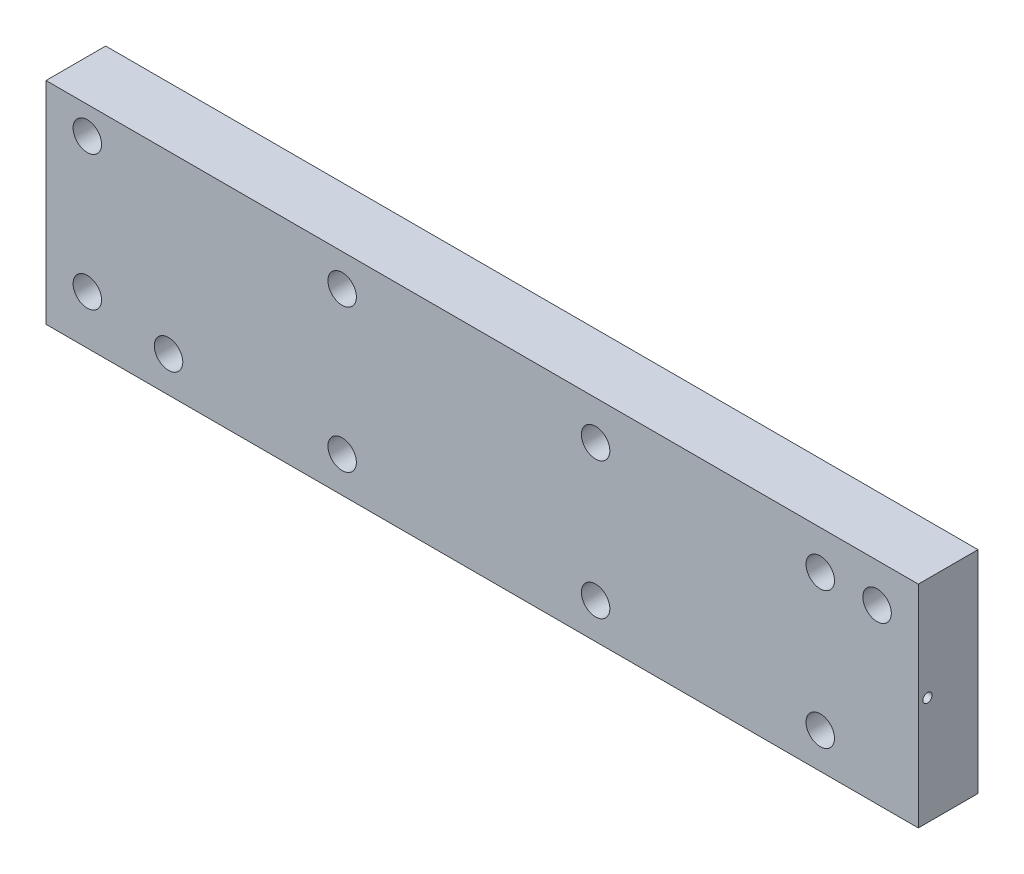
ISO-10303-21;
HEADER;
FILE_DESCRIPTION(('STEP AP214'),'2;1');
FILE_NAME('part.step','',(''),(''),'','','');
FILE_SCHEMA(('AUTOMOTIVE_DESIGN { 1 0 10303 214 1 1 1 1 }'));
ENDSEC;
DATA;
#1=APPLICATION_CONTEXT('core data for automotive mechanical design processes');
#2=APPLICATION_PROTOCOL_DEFINITION('international standard','automotive_design',2000,#1);
#3=PRODUCT_CONTEXT('',#1,'mechanical');
#4=PRODUCT('Part','Part','',(#3));
#5=PRODUCT_RELATED_PRODUCT_CATEGORY('part','',(#4));
#6=PRODUCT_DEFINITION_FORMATION('','',#4);
#7=PRODUCT_DEFINITION_CONTEXT('part definition',#1,'design');
#8=PRODUCT_DEFINITION('design','',#6,#7);
#9=PRODUCT_DEFINITION_SHAPE('','',#8);
#10=(LENGTH_UNIT() NAMED_UNIT(*) SI_UNIT(.MILLI.,.METRE.));
#11=(NAMED_UNIT(*) PLANE_ANGLE_UNIT() SI_UNIT($,.RADIAN.));
#12=(NAMED_UNIT(*) SI_UNIT($,.STERADIAN.) SOLID_ANGLE_UNIT());
#13=UNCERTAINTY_MEASURE_WITH_UNIT(LENGTH_MEASURE(1.E-05),#10,'distance_accuracy_value','');
#14=(GEOMETRIC_REPRESENTATION_CONTEXT(3) GLOBAL_UNCERTAINTY_ASSIGNED_CONTEXT((#13)) GLOBAL_UNIT_ASSIGNED_CONTEXT((#10,
#11,#12)) REPRESENTATION_CONTEXT('',''));
#15=CARTESIAN_POINT('',(0.,0.,0.));
#16=DIRECTION('',(0.,0.,1.));
#17=DIRECTION('',(1.,0.,0.));
#18=AXIS2_PLACEMENT_3D('',#15,#16,#17);
#19=CARTESIAN_POINT('',(12.49,31.,15.));
#20=DIRECTION('',(0.,0.,1.));
#21=DIRECTION('',(0.,-1.,0.));
#22=AXIS2_PLACEMENT_3D('',#19,#20,#21);
#23=PLANE('',#22);
#24=CARTESIAN_POINT('',(72.3541968671441,26.7675678602719,15.));
#25=DIRECTION('',(0.,0.,1.));
#26=DIRECTION('',(0.,-1.,0.));
#27=AXIS2_PLACEMENT_3D('',#24,#25,#26);
#28=CIRCLE('',#27,1.55);
#29=CARTESIAN_POINT('',(72.3541968671441,25.2175678602719,15.));
#30=VERTEX_POINT('',#29);
#31=EDGE_CURVE('E441',#30,#30,#28,.F.);
#32=ORIENTED_EDGE('',*,*,#31,.F.);
#33=EDGE_LOOP('',(#32));
#34=FACE_BOUND('',#33,.T.);
#35=CARTESIAN_POINT('',(103.008357344342,26.7675678602719,15.));
#36=DIRECTION('',(0.,0.,1.));
#37=DIRECTION('',(0.,-1.,0.));
#38=AXIS2_PLACEMENT_3D('',#35,#36,#37);
#39=CIRCLE('',#38,1.55);
#40=CARTESIAN_POINT('',(103.008357344342,25.2175678602719,15.));
#41=VERTEX_POINT('',#40);
#42=EDGE_CURVE('E436',#41,#41,#39,.F.);
#43=ORIENTED_EDGE('',*,*,#42,.F.);
#44=EDGE_LOOP('',(#43));
#45=FACE_BOUND('',#44,.T.);
#46=CARTESIAN_POINT('',(25.8461530651009,11.8834878470165,15.));
#47=DIRECTION('',(0.,0.,1.));
#48=DIRECTION('',(0.,-1.,0.));
#49=AXIS2_PLACEMENT_3D('',#46,#47,#48);
#50=CIRCLE('',#49,1.54999999999999);
#51=CARTESIAN_POINT('',(25.8461530651009,10.3334878470165,15.));
#52=VERTEX_POINT('',#51);
#53=EDGE_CURVE('E430',#52,#52,#50,.F.);
#54=ORIENTED_EDGE('',*,*,#53,.F.);
#55=EDGE_LOOP('',(#54));
#56=FACE_BOUND('',#55,.T.);
#57=CARTESIAN_POINT('',(72.3541968671441,11.8834878470165,15.));
#58=DIRECTION('',(0.,0.,1.));
#59=DIRECTION('',(0.,-1.,0.));
#60=AXIS2_PLACEMENT_3D('',#57,#58,#59);
#61=CIRCLE('',#60,1.55);
#62=CARTESIAN_POINT('',(72.3541968671441,10.3334878470165,15.));
#63=VERTEX_POINT('',#62);
#64=EDGE_CURVE('E424',#63,#63,#61,.F.);
#65=ORIENTED_EDGE('',*,*,#64,.F.);
#66=EDGE_LOOP('',(#65));
#67=FACE_BOUND('',#66,.T.);
#68=CARTESIAN_POINT('',(17.,28.,15.));
#69=DIRECTION('',(0.,0.,1.));
#70=DIRECTION('',(0.,-1.,0.));
#71=AXIS2_PLACEMENT_3D('',#68,#69,#70);
#72=CIRCLE('',#71,1.54999999999999);
#73=CARTESIAN_POINT('',(17.,26.45,15.));
#74=VERTEX_POINT('',#73);
#75=EDGE_CURVE('E419',#74,#74,#72,.F.);
#76=ORIENTED_EDGE('',*,*,#75,.F.);
#77=EDGE_LOOP('',(#76));
#78=FACE_BOUND('',#77,.T.);
#79=DIRECTION('',(0.,1.,0.));
#80=VECTOR('',#79,1.);
#81=CARTESIAN_POINT('',(14.5,19.4953488288822,15.));
#82=LINE('',#81,#80);
#83=CARTESIAN_POINT('',(14.5000000000001,22.5953488288822,15.));
#84=VERTEX_POINT('',#83);
#85=CARTESIAN_POINT('',(14.5,19.4953488288822,15.));
#86=VERTEX_POINT('',#85);
#87=EDGE_CURVE('E411',#84,#86,#82,.F.);
#88=ORIENTED_EDGE('',*,*,#87,.T.);
#89=DIRECTION('',(0.00465114596278457,0.999989183362117,0.));
#90=VECTOR('',#89,1.);
#91=CARTESIAN_POINT('',(14.5,19.4953488288822,15.));
#92=LINE('',#91,#90);
#93=CARTESIAN_POINT('',(14.4855814475155,16.3953823604596,15.));
#94=VERTEX_POINT('',#93);
#95=EDGE_CURVE('E59',#86,#94,#92,.F.);
#96=ORIENTED_EDGE('',*,*,#95,.T.);
#97=DIRECTION('',(0.999989183362117,-0.00465114596278426,0.));
#98=VECTOR('',#97,1.);
#99=CARTESIAN_POINT('',(-1318.49761349806,22.5953488288822,15.));
#100=LINE('',#99,#98);
#101=CARTESIAN_POINT('',(19.985521956007,16.3698010576642,15.));
#102=VERTEX_POINT('',#101);
#103=EDGE_CURVE('E410',#94,#102,#100,.T.);
#104=ORIENTED_EDGE('',*,*,#103,.T.);
#105=DIRECTION('',(0.00465114596278391,0.999989183362117,0.));
#106=VECTOR('',#105,1.);
#107=CARTESIAN_POINT('',(20.,19.4825581083082,15.));
#108=LINE('',#107,#106);
#109=CARTESIAN_POINT('',(19.9738940911,13.869828099259,15.));
#110=VERTEX_POINT('',#109);
#111=EDGE_CURVE('E455',#102,#110,#108,.F.);
#112=ORIENTED_EDGE('',*,*,#111,.T.);
#113=DIRECTION('',(0.999859873952876,0.0167401451289695,0.));
#114=VECTOR('',#113,1.);
#115=CARTESIAN_POINT('',(314.329260657533,18.7980702301612,15.));
#116=LINE('',#115,#114);
#117=CARTESIAN_POINT('',(99.980989793061,15.2093461940355,15.));
#118=VERTEX_POINT('',#117);
#119=EDGE_CURVE('E389',#110,#118,#116,.T.);
#120=ORIENTED_EDGE('',*,*,#119,.T.);
#121=DIRECTION('',(0.00465114596277969,0.999989183362117,0.));
#122=VECTOR('',#121,1.);
#123=CARTESIAN_POINT('',(100.,19.2965112635962,15.));
#124=LINE('',#123,#122);
#125=CARTESIAN_POINT('',(99.9926176579679,17.7093191524382,15.));
#126=VERTEX_POINT('',#125);
#127=EDGE_CURVE('E384',#118,#126,#124,.T.);
#128=ORIENTED_EDGE('',*,*,#127,.T.);
#129=DIRECTION('',(0.999989183362117,-0.00465114596278422,0.));
#130=VECTOR('',#129,1.);
#131=CARTESIAN_POINT('',(-582.498768257076,20.8837205430223,15.));
#132=LINE('',#131,#130);
#133=CARTESIAN_POINT('',(105.49255816646,17.6837378496429,15.));
#134=VERTEX_POINT('',#133);
#135=EDGE_CURVE('E377',#126,#134,#132,.T.);
#136=ORIENTED_EDGE('',*,*,#135,.T.);
#137=DIRECTION('',(0.00465114596278457,0.999989183362117,0.));
#138=VECTOR('',#137,1.);
#139=CARTESIAN_POINT('',(105.5,19.2837205430222,15.));
#140=LINE('',#139,#138);
#141=CARTESIAN_POINT('',(105.5,19.2837205430222,15.));
#142=VERTEX_POINT('',#141);
#143=EDGE_CURVE('E11',#134,#142,#140,.T.);
#144=ORIENTED_EDGE('',*,*,#143,.T.);
#145=DIRECTION('',(0.,1.,0.));
#146=VECTOR('',#145,1.);
#147=CARTESIAN_POINT('',(105.5,19.2837205430222,15.));
#148=LINE('',#147,#146);
#149=CARTESIAN_POINT('',(105.5,20.8837205430222,15.));
#150=VERTEX_POINT('',#149);
#151=EDGE_CURVE('E45',#142,#150,#148,.T.);
#152=ORIENTED_EDGE('',*,*,#151,.T.);
#153=DIRECTION('',(-1.,0.,0.));
#154=VECTOR('',#153,1.);
#155=CARTESIAN_POINT('',(-582.498768257076,20.8837205430223,15.));
#156=LINE('',#155,#154);
#157=CARTESIAN_POINT('',(100.,20.8837205430222,15.));
#158=VERTEX_POINT('',#157);
#159=EDGE_CURVE('E383',#150,#158,#156,.T.);
#160=ORIENTED_EDGE('',*,*,#159,.T.);
#161=DIRECTION('',(0.,1.,0.));
#162=VECTOR('',#161,1.);
#163=CARTESIAN_POINT('',(100.,19.2965112635962,15.));
#164=LINE('',#163,#162);
#165=CARTESIAN_POINT('',(100.,23.3837205430197,15.));
#166=VERTEX_POINT('',#165);
#167=EDGE_CURVE('E392',#158,#166,#164,.T.);
#168=ORIENTED_EDGE('',*,*,#167,.T.);
#169=DIRECTION('',(-0.999771197972252,0.0213904582729674,0.));
#170=VECTOR('',#169,1.);
#171=CARTESIAN_POINT('',(314.329260657533,18.7980702301612,15.));
#172=LINE('',#171,#170);
#173=CARTESIAN_POINT('',(20.,25.0953488288822,15.));
#174=VERTEX_POINT('',#173);
#175=EDGE_CURVE('E414',#166,#174,#172,.T.);
#176=ORIENTED_EDGE('',*,*,#175,.T.);
#177=DIRECTION('',(0.,1.,0.));
#178=VECTOR('',#177,1.);
#179=CARTESIAN_POINT('',(20.,19.4825581083082,15.));
#180=LINE('',#179,#178);
#181=CARTESIAN_POINT('',(20.,22.5953488288823,15.));
#182=VERTEX_POINT('',#181);
#183=EDGE_CURVE('E460',#174,#182,#180,.F.);
#184=ORIENTED_EDGE('',*,*,#183,.T.);
#185=DIRECTION('',(-1.,0.,0.));
#186=VECTOR('',#185,1.);
#187=CARTESIAN_POINT('',(-1318.49761349806,22.5953488288822,15.));
#188=LINE('',#187,#186);
#189=EDGE_CURVE('E407',#182,#84,#188,.T.);
#190=ORIENTED_EDGE('',*,*,#189,.T.);
#191=EDGE_LOOP('',(#88,#96,#104,#112,#120,#128,#136,#144,#152,#160,#168,#176,#184,#190));
#192=FACE_BOUND('',#191,.T.);
#193=DIRECTION('',(1.,0.,0.));
#194=VECTOR('',#193,1.);
#195=CARTESIAN_POINT('',(135.,31.,15.));
#196=LINE('',#195,#194);
#197=CARTESIAN_POINT('',(12.5,31.,15.));
#198=VERTEX_POINT('',#197);
#199=CARTESIAN_POINT('',(107.5,31.,15.));
#200=VERTEX_POINT('',#199);
#201=EDGE_CURVE('E446',#198,#200,#196,.T.);
#202=ORIENTED_EDGE('',*,*,#201,.T.);
#203=DIRECTION('',(0.,1.,0.));
#204=VECTOR('',#203,1.);
#205=CARTESIAN_POINT('',(107.5,-104.,15.));
#206=LINE('',#205,#204);
#207=CARTESIAN_POINT('',(107.5,8.,15.));
#208=VERTEX_POINT('',#207);
#209=EDGE_CURVE('E147',#208,#200,#206,.T.);
#210=ORIENTED_EDGE('',*,*,#209,.F.);
#211=DIRECTION('',(1.,0.,0.));
#212=VECTOR('',#211,1.);
#213=CARTESIAN_POINT('',(135.,8.,15.));
#214=LINE('',#213,#212);
#215=CARTESIAN_POINT('',(12.5,8.,15.));
#216=VERTEX_POINT('',#215);
#217=EDGE_CURVE('E444',#216,#208,#214,.T.);
#218=ORIENTED_EDGE('',*,*,#217,.F.);
#219=DIRECTION('',(0.,-1.,0.));
#220=VECTOR('',#219,1.);
#221=CARTESIAN_POINT('',(12.5,-104.,15.));
#222=LINE('',#221,#220);
#223=EDGE_CURVE('E230',#198,#216,#222,.T.);
#224=ORIENTED_EDGE('',*,*,#223,.F.);
#225=EDGE_LOOP('',(#202,#210,#218,#224));
#226=FACE_BOUND('',#225,.T.);
#227=CARTESIAN_POINT('',(96.8197135493571,11.8834878470165,15.));
#228=DIRECTION('',(0.,0.,1.));
#229=DIRECTION('',(0.,-1.,0.));
#230=AXIS2_PLACEMENT_3D('',#227,#228,#229);
#231=CIRCLE('',#230,1.55);
#232=CARTESIAN_POINT('',(96.8197135493571,10.3334878470165,15.));
#233=VERTEX_POINT('',#232);
#234=EDGE_CURVE('E422',#233,#233,#231,.F.);
#235=ORIENTED_EDGE('',*,*,#234,.F.);
#236=EDGE_LOOP('',(#235));
#237=FACE_BOUND('',#236,.T.);
#238=CARTESIAN_POINT('',(44.7527820765865,11.8834878470165,15.));
#239=DIRECTION('',(0.,0.,1.));
#240=DIRECTION('',(0.,-1.,0.));
#241=AXIS2_PLACEMENT_3D('',#238,#239,#240);
#242=CIRCLE('',#241,1.55);
#243=CARTESIAN_POINT('',(44.7527820765865,10.3334878470165,15.));
#244=VERTEX_POINT('',#243);
#245=EDGE_CURVE('E427',#244,#244,#242,.F.);
#246=ORIENTED_EDGE('',*,*,#245,.F.);
#247=EDGE_LOOP('',(#246));
#248=FACE_BOUND('',#247,.T.);
#249=CARTESIAN_POINT('',(17.,13.3193439369581,15.));
#250=DIRECTION('',(0.,0.,1.));
#251=DIRECTION('',(0.,-1.,0.));
#252=AXIS2_PLACEMENT_3D('',#249,#250,#251);
#253=CIRCLE('',#252,1.54999999999999);
#254=CARTESIAN_POINT('',(17.,11.7693439369581,15.));
#255=VERTEX_POINT('',#254);
#256=EDGE_CURVE('E433',#255,#255,#253,.F.);
#257=ORIENTED_EDGE('',*,*,#256,.F.);
#258=EDGE_LOOP('',(#257));
#259=FACE_BOUND('',#258,.T.);
#260=CARTESIAN_POINT('',(96.8197135493571,26.7675678602719,15.));
#261=DIRECTION('',(0.,0.,1.));
#262=DIRECTION('',(0.,-1.,0.));
#263=AXIS2_PLACEMENT_3D('',#260,#261,#262);
#264=CIRCLE('',#263,1.55);
#265=CARTESIAN_POINT('',(96.8197135493571,25.2175678602719,15.));
#266=VERTEX_POINT('',#265);
#267=EDGE_CURVE('E439',#266,#266,#264,.F.);
#268=ORIENTED_EDGE('',*,*,#267,.F.);
#269=EDGE_LOOP('',(#268));
#270=FACE_BOUND('',#269,.T.);
#271=CARTESIAN_POINT('',(44.7527820765865,27.4726032293202,15.));
#272=DIRECTION('',(0.,0.,1.));
#273=DIRECTION('',(0.,-1.,0.));
#274=AXIS2_PLACEMENT_3D('',#271,#272,#273);
#275=CIRCLE('',#274,1.55);
#276=CARTESIAN_POINT('',(44.7527820765865,25.9226032293202,15.));
#277=VERTEX_POINT('',#276);
#278=EDGE_CURVE('E40',#277,#277,#275,.F.);
#279=ORIENTED_EDGE('',*,*,#278,.F.);
#280=EDGE_LOOP('',(#279));
#281=FACE_BOUND('',#280,.T.);
#282=ADVANCED_FACE('F37',(#34,#45,#56,#67,#78,#192,#226,#237,#248,#259,#270,#281),#23,.F.);
#283=CARTESIAN_POINT('',(99.,20.,16.));
#284=DIRECTION('',(0.,0.,1.));
#285=DIRECTION('',(1.,0.,0.));
#286=AXIS2_PLACEMENT_3D('',#283,#284,#285);
#287=CYLINDRICAL_SURFACE('',#286,0.499999999999999);
#288=DIRECTION('',(0.,0.,1.));
#289=VECTOR('',#288,1.);
#290=CARTESIAN_POINT('',(98.95,19.5025062814467,16.));
#291=LINE('',#290,#289);
#292=CARTESIAN_POINT('',(98.95,19.5025062814467,20.919118057874));
#293=VERTEX_POINT('',#292);
#294=CARTESIAN_POINT('',(98.95,19.5025062814467,20.0860205677891));
#295=VERTEX_POINT('',#294);
#296=EDGE_CURVE('E228',#293,#295,#291,.F.);
#297=ORIENTED_EDGE('',*,*,#296,.T.);
#298=CARTESIAN_POINT('',(99.4701014681041,19.8296926023733,21.));
#299=CARTESIAN_POINT('',(99.4774688546878,19.8499127723279,20.9979842904962));
#300=CARTESIAN_POINT('',(99.4834085464336,19.8704958048309,20.9946040285803));
#301=CARTESIAN_POINT('',(99.4925442452967,19.9115218747577,20.9851516344699));
#302=CARTESIAN_POINT('',(99.495756197269,19.9319650230435,20.979095465069));
#303=CARTESIAN_POINT('',(99.4996314927335,19.9721009031409,20.9643045231302));
#304=CARTESIAN_POINT('',(99.5002948625877,19.9917936427125,20.9555697782999));
#305=CARTESIAN_POINT('',(99.4994706969462,20.0298587441883,20.9356586299746));
#306=CARTESIAN_POINT('',(99.4979811139956,20.0482298317554,20.9244799108475));
#307=CARTESIAN_POINT('',(99.4932647506171,20.0838004227334,20.8995903586521));
#308=CARTESIAN_POINT('',(99.4899837937804,20.1009434640651,20.8858098217039));
#309=CARTESIAN_POINT('',(99.4822336342976,20.1331361659019,20.8562846501941));
#310=CARTESIAN_POINT('',(99.4777637694054,20.148184652559,20.8405389235843));
#311=CARTESIAN_POINT('',(99.4672837241488,20.1787609896256,20.8040947204159));
#312=CARTESIAN_POINT('',(99.4611432182762,20.1938082661447,20.7830295939592));
#313=CARTESIAN_POINT('',(99.4489884944372,20.2205107731916,20.7387862072529));
#314=CARTESIAN_POINT('',(99.4429744382683,20.2321618773428,20.7156054209708));
#315=CARTESIAN_POINT('',(99.4314867831335,20.2529353790743,20.6647084715541));
#316=CARTESIAN_POINT('',(99.4261530042551,20.2616179526596,20.6367765523052));
#317=CARTESIAN_POINT('',(99.4183182044755,20.2739829819091,20.5794726795957));
#318=CARTESIAN_POINT('',(99.4158101298066,20.2776778928029,20.5501045037275));
#319=CARTESIAN_POINT('',(99.4144741278076,20.2796626470272,20.4951847310749));
#320=CARTESIAN_POINT('',(99.4151850689781,20.2786295427458,20.4696672234916));
#321=CARTESIAN_POINT('',(99.4190797874766,20.2727343555928,20.419265578987));
#322=CARTESIAN_POINT('',(99.4222654437116,20.2678693633527,20.3943819381562));
#323=CARTESIAN_POINT('',(99.4301885645206,20.2549331699153,20.3472693659653));
#324=CARTESIAN_POINT('',(99.4348301847968,20.2470547145151,20.3249697408449));
#325=CARTESIAN_POINT('',(99.4449475443564,20.2283305472458,20.2818488804111));
#326=CARTESIAN_POINT('',(99.4504239036889,20.2174826248315,20.2610287610805));
#327=CARTESIAN_POINT('',(99.4624244368935,20.1908230760405,20.2175802674018));
#328=CARTESIAN_POINT('',(99.4689624890417,20.1744727084044,20.1952842055542));
#329=CARTESIAN_POINT('',(99.4809181656528,20.1381400597493,20.1535245114158));
#330=CARTESIAN_POINT('',(99.4863366101286,20.1181604571199,20.1340588092574));
#331=CARTESIAN_POINT('',(99.4940278146444,20.0790790660161,20.1019380807881));
#332=CARTESIAN_POINT('',(99.4967045460814,20.0605436449207,20.0886928309633));
#333=CARTESIAN_POINT('',(99.49990775248,20.0216994598741,20.0647917445634));
#334=CARTESIAN_POINT('',(99.5004362504364,20.001392382715,20.0541334807194));
#335=CARTESIAN_POINT('',(99.4987966969851,19.9594473548212,20.0356735523955));
#336=CARTESIAN_POINT('',(99.4966113200138,19.937801700056,20.027890657647));
#337=CARTESIAN_POINT('',(99.4891659120319,19.8941410152587,20.0154624482384));
#338=CARTESIAN_POINT('',(99.4839070133731,19.872126124161,20.010815979409));
#339=CARTESIAN_POINT('',(99.470986951121,19.830917816833,20.0048746038622));
#340=CARTESIAN_POINT('',(99.4636326262835,19.8116691421163,20.0032813070208));
#341=CARTESIAN_POINT('',(99.4465781960761,19.7741856430768,20.002241481801));
#342=CARTESIAN_POINT('',(99.4368775611793,19.755951048761,20.0027954384501));
#343=CARTESIAN_POINT('',(99.4148955209144,19.7201372189167,20.0057146824016));
#344=CARTESIAN_POINT('',(99.402517663202,19.7026243477743,20.0081603180715));
#345=CARTESIAN_POINT('',(99.3757751596434,19.6694741611717,20.0144361803188));
#346=CARTESIAN_POINT('',(99.3614097139939,19.6538376054926,20.018266965285));
#347=CARTESIAN_POINT('',(99.3282394656705,19.6220089808324,20.0275393655168));
#348=CARTESIAN_POINT('',(99.3090997224873,19.6062142755736,20.033146374118));
#349=CARTESIAN_POINT('',(99.2687439855616,19.5776382793501,20.0446790088129));
#350=CARTESIAN_POINT('',(99.2475248511638,19.564861649232,20.0506051105801));
#351=CARTESIAN_POINT('',(99.1997933230874,19.5407548740718,20.0627781922216));
#352=CARTESIAN_POINT('',(99.1729746016716,19.5299733635102,20.0689276106349));
#353=CARTESIAN_POINT('',(99.1175330796776,19.5131539614114,20.0790277069308));
#354=CARTESIAN_POINT('',(99.0889160072931,19.5071017585535,20.0829850076991));
#355=CARTESIAN_POINT('',(99.0417249554963,19.501408157889,20.0867432752652));
#356=CARTESIAN_POINT('',(99.0234073889952,19.5002140785748,20.0875461945066));
#357=CARTESIAN_POINT('',(98.9866811187587,19.4998368022868,20.0878105878154));
#358=CARTESIAN_POINT('',(98.9682723157987,19.500660387847,20.0872675372311));
#359=CARTESIAN_POINT('',(98.95,19.5025062814467,20.0860205677891));
#360=B_SPLINE_CURVE_WITH_KNOTS('',3,(#298,#299,#300,#301,#302,#303,#304,#305,#306,#307,#308,
#309,#310,#311,#312,#313,#314,#315,#316,#317,#318,#319,#320,#321,#322,#323,#324,#325,#326,#327,
#328,#329,#330,#331,#332,#333,#334,#335,#336,#337,#338,#339,#340,#341,#342,#343,#344,#345,#346,
#347,#348,#349,#350,#351,#352,#353,#354,#355,#356,#357,#358,#359),.UNSPECIFIED.,.F.,.F.,(4,2,2,
2,2,2,2,2,2,2,2,2,2,2,2,2,2,2,2,2,2,2,2,2,2,2,2,2,2,2,4),(0.,0.0647290245250579,0.1290770223543,
0.193424354580422,0.257832921303913,0.324306933423682,0.390818050749882,0.470321411939918,
0.549920971505537,0.638596933170055,0.727051040321775,0.803267833475031,0.879542550226478,
0.951587770671656,1.02368676991559,1.10854858975764,1.1933480338333,1.26188622253321,
1.33035985374064,1.39927288135139,1.46816053590199,1.52988145180107,1.591616310206,
1.65612784413127,1.72066541334236,1.79670117965547,1.87285361218891,1.9610538694392,
2.04898617970982,2.10395699193108,2.15911284612362),.UNSPECIFIED.);
#361=CARTESIAN_POINT('',(99.4701014681041,19.8296926023733,21.));
#362=VERTEX_POINT('',#361);
#363=EDGE_CURVE('E222',#362,#295,#360,.T.);
#364=ORIENTED_EDGE('',*,*,#363,.F.);
#365=CARTESIAN_POINT('',(99.,20.,21.));
#366=DIRECTION('',(0.,0.,1.));
#367=DIRECTION('',(1.,0.,0.));
#368=AXIS2_PLACEMENT_3D('',#365,#366,#367);
#369=CIRCLE('',#368,0.499999999999999);
#370=CARTESIAN_POINT('',(99.4198315160856,19.7284461414356,21.));
#371=VERTEX_POINT('',#370);
#372=EDGE_CURVE('E203',#362,#371,#369,.T.);
#373=ORIENTED_EDGE('',*,*,#372,.T.);
#374=CARTESIAN_POINT('',(98.95,19.5025062814467,20.919118057874));
#375=CARTESIAN_POINT('',(98.9624965972271,19.5012492106486,20.9182795934042));
#376=CARTESIAN_POINT('',(98.9750563476169,19.5004640640067,20.9177543183625));
#377=CARTESIAN_POINT('',(99.0002026466028,19.4998420414642,20.9173377679787));
#378=CARTESIAN_POINT('',(99.0127891761434,19.5000046322368,20.9174461360623));
#379=CARTESIAN_POINT('',(99.0502240641956,19.5019072607446,20.9187241382645));
#380=CARTESIAN_POINT('',(99.0749869604941,19.5050384579037,20.9208306896537));
#381=CARTESIAN_POINT('',(99.1234443958593,19.5148467577854,20.9270909126284));
#382=CARTESIAN_POINT('',(99.1471408686169,19.5215171367892,20.9312407014093));
#383=CARTESIAN_POINT('',(99.1931392384423,19.5381587409854,20.9408089746067));
#384=CARTESIAN_POINT('',(99.215436744906,19.5481397951203,20.9462312225886));
#385=CARTESIAN_POINT('',(99.2603261184848,19.5722834390689,20.9580217679895));
#386=CARTESIAN_POINT('',(99.2827403038141,19.5867557243691,20.9644309040114));
#387=CARTESIAN_POINT('',(99.325052222324,19.6191484020611,20.9766194595065));
#388=CARTESIAN_POINT('',(99.34495604051,19.6370601803873,20.9824003967983));
#389=CARTESIAN_POINT('',(99.3737920024126,19.667571024913,20.9901112422122));
#390=CARTESIAN_POINT('',(99.3837273004194,19.6790865492227,20.9926218508166));
#391=CARTESIAN_POINT('',(99.4025746948953,19.7030710978297,20.9969103213568));
#392=CARTESIAN_POINT('',(99.4114857036664,19.7155411127269,20.9986874094563));
#393=CARTESIAN_POINT('',(99.4198315160856,19.7284461414356,21.));
#394=B_SPLINE_CURVE_WITH_KNOTS('',3,(#374,#375,#376,#377,#378,#379,#380,#381,#382,#383,#384,
#385,#386,#387,#388,#389,#390,#391,#392,#393),.UNSPECIFIED.,.F.,.F.,(4,2,2,2,2,2,2,2,2,4),(0.,
0.037739301385199,0.075457367527859,0.150181501446608,0.224764180497007,0.299570297377233,
0.381566175862673,0.463359316092883,0.50953094221899,0.555751153924889),.UNSPECIFIED.);
#395=EDGE_CURVE('E227',#293,#371,#394,.T.);
#396=ORIENTED_EDGE('',*,*,#395,.F.);
#397=EDGE_LOOP('',(#297,#364,#373,#396));
#398=FACE_BOUND('',#397,.T.);
#399=CARTESIAN_POINT('',(98.6442776283622,19.6486288830235,19.0980535592392));
#400=CARTESIAN_POINT('',(98.6639118073722,19.6287532179292,19.099365509122));
#401=CARTESIAN_POINT('',(98.685238733778,19.6105041582648,19.1003615489505));
#402=CARTESIAN_POINT('',(98.7306702362938,19.5778076803801,19.1018334368221));
#403=CARTESIAN_POINT('',(98.7547777396331,19.5633643220794,19.1023087310269));
#404=CARTESIAN_POINT('',(98.8050603197376,19.5387172703958,19.1028520209217));
#405=CARTESIAN_POINT('',(98.8312342615941,19.5285112688281,19.1029202386271));
#406=CARTESIAN_POINT('',(98.8849126832868,19.5126209388884,19.1027453384334));
#407=CARTESIAN_POINT('',(98.9124168893627,19.5069356843381,19.1025022843322));
#408=CARTESIAN_POINT('',(98.9680452901828,19.5002346661814,19.1017677457356));
#409=CARTESIAN_POINT('',(98.9961706901737,19.4992289627337,19.1012757285298));
#410=CARTESIAN_POINT('',(99.0521888253917,19.5019410430946,19.1000664566654));
#411=CARTESIAN_POINT('',(99.0800815513319,19.505659014544,19.0993491930601));
#412=CARTESIAN_POINT('',(99.1348861022054,19.5177198154422,19.0976694539896));
#413=CARTESIAN_POINT('',(99.1617963513785,19.5260697541267,19.0967066028218));
#414=CARTESIAN_POINT('',(99.2138256100011,19.5471572736037,19.0944800116797));
#415=CARTESIAN_POINT('',(99.2389446205736,19.5598948516453,19.093216271894));
#416=CARTESIAN_POINT('',(99.2866853170021,19.5893918189684,19.09030480816));
#417=CARTESIAN_POINT('',(99.3093061782029,19.6061525305525,19.0886569579695));
#418=CARTESIAN_POINT('',(99.3513990857811,19.6432020444003,19.084884398081));
#419=CARTESIAN_POINT('',(99.3708711813345,19.6634907915546,19.0827596958314));
#420=CARTESIAN_POINT('',(99.4061212813782,19.7069993094862,19.0779485681146));
#421=CARTESIAN_POINT('',(99.4218992150937,19.7302191364055,19.0752621318871));
#422=CARTESIAN_POINT('',(99.4493304848308,19.7789053091294,19.0692700700642));
#423=CARTESIAN_POINT('',(99.4609838169861,19.8043716570397,19.0659644438884));
#424=CARTESIAN_POINT('',(99.4798982066447,19.8568938953284,19.0587079373691));
#425=CARTESIAN_POINT('',(99.4871448217275,19.883954696892,19.0547549886618));
#426=CARTESIAN_POINT('',(99.4970243233767,19.938813551295,19.0462517889327));
#427=CARTESIAN_POINT('',(99.4996569432006,19.9666116466642,19.0417015033943));
#428=CARTESIAN_POINT('',(99.5002837741891,20.0224949678258,19.0320469072202));
#429=CARTESIAN_POINT('',(99.4982238427238,20.0505797851252,19.026936783817));
#430=CARTESIAN_POINT('',(99.4894500775863,20.1059456990636,19.0163677454663));
#431=CARTESIAN_POINT('',(99.4827357137809,20.1332267037803,19.0109087908518));
#432=CARTESIAN_POINT('',(99.464703002911,20.1867109502839,18.999761628532));
#433=CARTESIAN_POINT('',(99.4533084021397,20.2128880195923,18.9940711018974));
#434=CARTESIAN_POINT('',(99.4262241375252,20.2629507258796,18.9828189886846));
#435=CARTESIAN_POINT('',(99.4105340972689,20.2868361617929,18.9772574134528));
#436=CARTESIAN_POINT('',(99.3751538085751,20.3317869411573,18.9665315772364));
#437=CARTESIAN_POINT('',(99.3554397970389,20.3528342376555,18.9613699401793));
#438=CARTESIAN_POINT('',(99.3125853936342,20.3913044219291,18.9518031550846));
#439=CARTESIAN_POINT('',(99.2894453672948,20.4087276958831,18.9473979264523));
#440=CARTESIAN_POINT('',(99.240885265801,20.439063424427,18.9397343162875));
#441=CARTESIAN_POINT('',(99.2155226955323,20.4520622460933,18.9364539658427));
#442=CARTESIAN_POINT('',(99.1628446214462,20.4735932912172,18.931165793708));
#443=CARTESIAN_POINT('',(99.1355296600271,20.4821267497681,18.9291576201091));
#444=CARTESIAN_POINT('',(99.080840932457,20.4941851496691,18.9266341237527));
#445=CARTESIAN_POINT('',(99.0535088004551,20.4978880040298,18.9260649996176));
#446=CARTESIAN_POINT('',(98.9986162897586,20.5007525594579,18.9263228837002));
#447=CARTESIAN_POINT('',(98.971055944331,20.4999149111548,18.9271496918768));
#448=CARTESIAN_POINT('',(98.9170837860674,20.4938091885474,18.9301251492837));
#449=CARTESIAN_POINT('',(98.8906600097688,20.4886324910256,18.9322462922626));
#450=CARTESIAN_POINT('',(98.8390939907852,20.4741588154427,18.937656787168));
#451=CARTESIAN_POINT('',(98.8139518406242,20.4648615403744,18.9409462233007));
#452=CARTESIAN_POINT('',(98.7651655498171,20.4422536958424,18.9485631241689));
#453=CARTESIAN_POINT('',(98.7415555738685,20.4288753542283,18.952907843799));
#454=CARTESIAN_POINT('',(98.6969024170357,20.3985728750711,18.9623514505185));
#455=CARTESIAN_POINT('',(98.6758597508033,20.3816480284253,18.9674504883694));
#456=CARTESIAN_POINT('',(98.636046646496,20.3439746927847,18.9783446009619));
#457=CARTESIAN_POINT('',(98.6174004588662,20.3231005296703,18.9841593363216));
#458=CARTESIAN_POINT('',(98.5838625724069,20.2785798297344,18.9960058742143));
#459=CARTESIAN_POINT('',(98.5689715444343,20.2549327986456,19.0020377153134));
#460=CARTESIAN_POINT('',(98.54295435188,20.204768197417,19.014202545222));
#461=CARTESIAN_POINT('',(98.5319478729173,20.1781879280341,19.0203335020105));
#462=CARTESIAN_POINT('',(98.514633622152,20.1234627879741,19.0322419059751));
#463=CARTESIAN_POINT('',(98.5083257296798,20.0953179574982,19.0380193622262));
#464=CARTESIAN_POINT('',(98.5006428886348,20.0383113989186,19.0489796465435));
#465=CARTESIAN_POINT('',(98.4992572273157,20.0094513655087,19.0541637421545));
#466=CARTESIAN_POINT('',(98.5014940438912,19.9517932740901,19.0637852284013));
#467=CARTESIAN_POINT('',(98.505116956392,19.9229952216768,19.0682225542006));
#468=CARTESIAN_POINT('',(98.5171909557283,19.866960611517,19.0761666260789));
#469=CARTESIAN_POINT('',(98.52553640299,19.8397037832456,19.0796913520835));
#470=CARTESIAN_POINT('',(98.5467735494023,19.78694493572,19.0859087071225));
#471=CARTESIAN_POINT('',(98.5596598991785,19.7614408936755,19.0886023082841));
#472=CARTESIAN_POINT('',(98.5845106227582,19.7212114142872,19.0924194654993));
#473=CARTESIAN_POINT('',(98.5953002308935,19.7057683264934,19.0937655040497));
#474=CARTESIAN_POINT('',(98.6185624392304,19.6761798159928,19.0961401146563));
#475=CARTESIAN_POINT('',(98.6310350129923,19.6620343729057,19.097168691699));
#476=CARTESIAN_POINT('',(98.6442776283622,19.6486288830235,19.0980535592392));
#477=B_SPLINE_CURVE_WITH_KNOTS('',3,(#399,#400,#401,#402,#403,#404,#405,#406,#407,#408,#409,
#410,#411,#412,#413,#414,#415,#416,#417,#418,#419,#420,#421,#422,#423,#424,#425,#426,#427,#428,
#429,#430,#431,#432,#433,#434,#435,#436,#437,#438,#439,#440,#441,#442,#443,#444,#445,#446,#447,
#448,#449,#450,#451,#452,#453,#454,#455,#456,#457,#458,#459,#460,#461,#462,#463,#464,#465,#466,
#467,#468,#469,#470,#471,#472,#473,#474,#475,#476),.UNSPECIFIED.,.T.,.F.,(4,2,2,2,2,2,2,2,2,2,2,
2,2,2,2,2,2,2,2,2,2,2,2,2,2,2,2,2,2,2,2,2,2,2,2,2,2,2,4),(0.,0.0838381024969042,
0.167765284593441,0.251646689467256,0.335510904889217,0.41955532962654,0.503603093004901,
0.587780212912464,0.671957280044491,0.756162052030788,0.840365508818735,0.924570578690833,
1.00877572749292,1.09325538052217,1.17773991729511,1.26320416627443,1.34867815111035,
1.4356037568699,1.5225369824367,1.60999926036542,1.69745221346334,1.78308429614242,
1.86869268095502,1.9510496814232,2.03339488089235,2.11404829618687,2.19470752584702,
2.27678675386831,2.3588824088315,2.44425551695862,2.5296438661483,2.61747118228328,
2.70529624274852,2.7929300432009,2.88057144832918,2.96632576498255,3.05197939531753,
3.10852635785895,3.16507243213804),.UNSPECIFIED.);
#478=CARTESIAN_POINT('',(98.6442776283622,19.6486288830235,19.0980535592392));
#479=VERTEX_POINT('',#478);
#480=EDGE_CURVE('E271',#479,#479,#477,.T.);
#481=ORIENTED_EDGE('',*,*,#480,.F.);
#482=EDGE_LOOP('',(#481));
#483=FACE_BOUND('',#482,.T.);
#484=ADVANCED_FACE('F261',(#398,#483),#287,.F.);
#485=CARTESIAN_POINT('',(135.,31.,0.));
#486=DIRECTION('',(0.,1.,0.));
#487=DIRECTION('',(0.,0.,1.));
#488=AXIS2_PLACEMENT_3D('',#485,#486,#487);
#489=PLANE('',#488);
#490=ORIENTED_EDGE('',*,*,#201,.F.);
#491=DIRECTION('',(0.,0.,-1.));
#492=VECTOR('',#491,1.);
#493=CARTESIAN_POINT('',(12.5,31.,21.5));
#494=LINE('',#493,#492);
#495=CARTESIAN_POINT('',(12.5,31.,21.5));
#496=VERTEX_POINT('',#495);
#497=EDGE_CURVE('E166',#496,#198,#494,.T.);
#498=ORIENTED_EDGE('',*,*,#497,.F.);
#499=DIRECTION('',(-1.,0.,0.));
#500=VECTOR('',#499,1.);
#501=CARTESIAN_POINT('',(135.,31.,21.5));
#502=LINE('',#501,#500);
#503=CARTESIAN_POINT('',(107.5,31.,21.5));
#504=VERTEX_POINT('',#503);
#505=EDGE_CURVE('E158',#504,#496,#502,.T.);
#506=ORIENTED_EDGE('',*,*,#505,.F.);
#507=DIRECTION('',(0.,0.,1.));
#508=VECTOR('',#507,1.);
#509=CARTESIAN_POINT('',(107.5,31.,21.5));
#510=LINE('',#509,#508);
#511=EDGE_CURVE('E140',#200,#504,#510,.T.);
#512=ORIENTED_EDGE('',*,*,#511,.F.);
#513=EDGE_LOOP('',(#490,#498,#506,#512));
#514=FACE_BOUND('',#513,.T.);
#515=ADVANCED_FACE('F164',(#514),#489,.T.);
#516=CARTESIAN_POINT('',(135.,7.99999999999999,0.));
#517=DIRECTION('',(0.,1.,0.));
#518=DIRECTION('',(0.,0.,1.));
#519=AXIS2_PLACEMENT_3D('',#516,#517,#518);
#520=PLANE('',#519);
#521=DIRECTION('',(0.,0.,-1.));
#522=VECTOR('',#521,1.);
#523=CARTESIAN_POINT('',(12.5,7.99999999999999,0.));
#524=LINE('',#523,#522);
#525=CARTESIAN_POINT('',(12.5,7.99999999999999,21.5));
#526=VERTEX_POINT('',#525);
#527=EDGE_CURVE('E172',#526,#216,#524,.T.);
#528=ORIENTED_EDGE('',*,*,#527,.T.);
#529=ORIENTED_EDGE('',*,*,#217,.T.);
#530=DIRECTION('',(0.,0.,1.));
#531=VECTOR('',#530,1.);
#532=CARTESIAN_POINT('',(107.5,7.99999999999999,0.));
#533=LINE('',#532,#531);
#534=CARTESIAN_POINT('',(107.5,7.99999999999999,21.5));
#535=VERTEX_POINT('',#534);
#536=EDGE_CURVE('E471',#208,#535,#533,.T.);
#537=ORIENTED_EDGE('',*,*,#536,.T.);
#538=DIRECTION('',(-1.,0.,0.));
#539=VECTOR('',#538,1.);
#540=CARTESIAN_POINT('',(135.,8.,21.5));
#541=LINE('',#540,#539);
#542=EDGE_CURVE('E160',#535,#526,#541,.T.);
#543=ORIENTED_EDGE('',*,*,#542,.T.);
#544=EDGE_LOOP('',(#528,#529,#537,#543));
#545=FACE_BOUND('',#544,.T.);
#546=ADVANCED_FACE('F308',(#545),#520,.F.);
#547=CARTESIAN_POINT('',(135.,0.,21.5));
#548=DIRECTION('',(0.,0.,-1.));
#549=DIRECTION('',(-1.,0.,0.));
#550=AXIS2_PLACEMENT_3D('',#547,#548,#549);
#551=PLANE('',#550);
#552=CARTESIAN_POINT('',(72.3541968671441,11.8834878470165,21.5));
#553=DIRECTION('',(0.,0.,-1.));
#554=DIRECTION('',(-1.,0.,0.));
#555=AXIS2_PLACEMENT_3D('',#552,#553,#554);
#556=CIRCLE('',#555,1.55);
#557=CARTESIAN_POINT('',(70.8041968671441,11.8834878470165,21.5));
#558=VERTEX_POINT('',#557);
#559=EDGE_CURVE('E197',#558,#558,#556,.F.);
#560=ORIENTED_EDGE('',*,*,#559,.F.);
#561=EDGE_LOOP('',(#560));
#562=FACE_BOUND('',#561,.T.);
#563=CARTESIAN_POINT('',(25.8461530651009,11.8834878470165,21.5));
#564=DIRECTION('',(0.,0.,-1.));
#565=DIRECTION('',(-1.,0.,0.));
#566=AXIS2_PLACEMENT_3D('',#563,#564,#565);
#567=CIRCLE('',#566,1.54999999999999);
#568=CARTESIAN_POINT('',(24.2961530651009,11.8834878470165,21.5));
#569=VERTEX_POINT('',#568);
#570=EDGE_CURVE('E191',#569,#569,#567,.F.);
#571=ORIENTED_EDGE('',*,*,#570,.F.);
#572=EDGE_LOOP('',(#571));
#573=FACE_BOUND('',#572,.T.);
#574=CARTESIAN_POINT('',(103.008357344342,26.7675678602719,21.5));
#575=DIRECTION('',(0.,0.,-1.));
#576=DIRECTION('',(-1.,0.,0.));
#577=AXIS2_PLACEMENT_3D('',#574,#575,#576);
#578=CIRCLE('',#577,1.55);
#579=CARTESIAN_POINT('',(101.458357344342,26.7675678602719,21.5));
#580=VERTEX_POINT('',#579);
#581=EDGE_CURVE('E185',#580,#580,#578,.F.);
#582=ORIENTED_EDGE('',*,*,#581,.F.);
#583=EDGE_LOOP('',(#582));
#584=FACE_BOUND('',#583,.T.);
#585=CARTESIAN_POINT('',(72.3541968671441,26.7675678602719,21.5));
#586=DIRECTION('',(0.,0.,-1.));
#587=DIRECTION('',(-1.,0.,0.));
#588=AXIS2_PLACEMENT_3D('',#585,#586,#587);
#589=CIRCLE('',#588,1.55);
#590=CARTESIAN_POINT('',(70.8041968671441,26.7675678602719,21.5));
#591=VERTEX_POINT('',#590);
#592=EDGE_CURVE('E179',#591,#591,#589,.F.);
#593=ORIENTED_EDGE('',*,*,#592,.F.);
#594=EDGE_LOOP('',(#593));
#595=FACE_BOUND('',#594,.T.);
#596=CARTESIAN_POINT('',(17.,28.,21.5));
#597=DIRECTION('',(0.,0.,-1.));
#598=DIRECTION('',(-1.,0.,0.));
#599=AXIS2_PLACEMENT_3D('',#596,#597,#598);
#600=CIRCLE('',#599,1.54999999999999);
#601=CARTESIAN_POINT('',(15.45,28.,21.5));
#602=VERTEX_POINT('',#601);
#603=EDGE_CURVE('E167',#602,#602,#600,.F.);
#604=ORIENTED_EDGE('',*,*,#603,.F.);
#605=EDGE_LOOP('',(#604));
#606=FACE_BOUND('',#605,.T.);
#607=CARTESIAN_POINT('',(44.7527820765865,27.4726032293202,21.5));
#608=DIRECTION('',(0.,0.,-1.));
#609=DIRECTION('',(-1.,0.,0.));
#610=AXIS2_PLACEMENT_3D('',#607,#608,#609);
#611=CIRCLE('',#610,1.55);
#612=CARTESIAN_POINT('',(43.2027820765865,27.4726032293202,21.5));
#613=VERTEX_POINT('',#612);
#614=EDGE_CURVE('E170',#613,#613,#611,.F.);
#615=ORIENTED_EDGE('',*,*,#614,.F.);
#616=EDGE_LOOP('',(#615));
#617=FACE_BOUND('',#616,.T.);
#618=CARTESIAN_POINT('',(96.8197135493571,26.7675678602719,21.5));
#619=DIRECTION('',(0.,0.,-1.));
#620=DIRECTION('',(-1.,0.,0.));
#621=AXIS2_PLACEMENT_3D('',#618,#619,#620);
#622=CIRCLE('',#621,1.55);
#623=CARTESIAN_POINT('',(95.2697135493571,26.7675678602719,21.5));
#624=VERTEX_POINT('',#623);
#625=EDGE_CURVE('E182',#624,#624,#622,.F.);
#626=ORIENTED_EDGE('',*,*,#625,.F.);
#627=EDGE_LOOP('',(#626));
#628=FACE_BOUND('',#627,.T.);
#629=CARTESIAN_POINT('',(17.,13.3193439369581,21.5));
#630=DIRECTION('',(0.,0.,-1.));
#631=DIRECTION('',(-1.,0.,0.));
#632=AXIS2_PLACEMENT_3D('',#629,#630,#631);
#633=CIRCLE('',#632,1.54999999999999);
#634=CARTESIAN_POINT('',(15.45,13.3193439369581,21.5));
#635=VERTEX_POINT('',#634);
#636=EDGE_CURVE('E188',#635,#635,#633,.F.);
#637=ORIENTED_EDGE('',*,*,#636,.F.);
#638=EDGE_LOOP('',(#637));
#639=FACE_BOUND('',#638,.T.);
#640=CARTESIAN_POINT('',(44.7527820765865,11.8834878470165,21.5));
#641=DIRECTION('',(0.,0.,-1.));
#642=DIRECTION('',(-1.,0.,0.));
#643=AXIS2_PLACEMENT_3D('',#640,#641,#642);
#644=CIRCLE('',#643,1.55);
#645=CARTESIAN_POINT('',(43.2027820765865,11.8834878470165,21.5));
#646=VERTEX_POINT('',#645);
#647=EDGE_CURVE('E194',#646,#646,#644,.F.);
#648=ORIENTED_EDGE('',*,*,#647,.F.);
#649=EDGE_LOOP('',(#648));
#650=FACE_BOUND('',#649,.T.);
#651=CARTESIAN_POINT('',(96.8197135493571,11.8834878470165,21.5));
#652=DIRECTION('',(0.,0.,-1.));
#653=DIRECTION('',(-1.,0.,0.));
#654=AXIS2_PLACEMENT_3D('',#651,#652,#653);
#655=CIRCLE('',#654,1.55);
#656=CARTESIAN_POINT('',(95.2697135493571,11.8834878470165,21.5));
#657=VERTEX_POINT('',#656);
#658=EDGE_CURVE('E200',#657,#657,#655,.F.);
#659=ORIENTED_EDGE('',*,*,#658,.F.);
#660=EDGE_LOOP('',(#659));
#661=FACE_BOUND('',#660,.T.);
#662=ORIENTED_EDGE('',*,*,#542,.F.);
#663=DIRECTION('',(0.,1.,0.));
#664=VECTOR('',#663,1.);
#665=CARTESIAN_POINT('',(107.5,-104.,21.5));
#666=LINE('',#665,#664);
#667=EDGE_CURVE('E144',#535,#504,#666,.T.);
#668=ORIENTED_EDGE('',*,*,#667,.T.);
#669=ORIENTED_EDGE('',*,*,#505,.T.);
#670=DIRECTION('',(0.,1.,0.));
#671=VECTOR('',#670,1.);
#672=CARTESIAN_POINT('',(12.5,-104.,21.5));
#673=LINE('',#672,#671);
#674=EDGE_CURVE('E152',#526,#496,#673,.T.);
#675=ORIENTED_EDGE('',*,*,#674,.F.);
#676=EDGE_LOOP('',(#662,#668,#669,#675));
#677=FACE_BOUND('',#676,.T.);
#678=ADVANCED_FACE('F156',(#562,#573,#584,#595,#606,#617,#628,#639,#650,#661,#677),#551,.F.);
#679=CARTESIAN_POINT('',(44.7527820765865,27.4726032293202,0.));
#680=DIRECTION('',(0.,0.,-1.));
#681=DIRECTION('',(-1.,0.,0.));
#682=AXIS2_PLACEMENT_3D('',#679,#680,#681);
#683=CYLINDRICAL_SURFACE('',#682,1.55);
#684=ORIENTED_EDGE('',*,*,#278,.T.);
#685=EDGE_LOOP('',(#684));
#686=FACE_BOUND('',#685,.T.);
#687=ORIENTED_EDGE('',*,*,#614,.T.);
#688=EDGE_LOOP('',(#687));
#689=FACE_BOUND('',#688,.T.);
#690=ADVANCED_FACE('F314',(#686,#689),#683,.F.);
#691=CARTESIAN_POINT('',(72.3541968671441,26.7675678602719,0.));
#692=DIRECTION('',(0.,0.,-1.));
#693=DIRECTION('',(-1.,0.,0.));
#694=AXIS2_PLACEMENT_3D('',#691,#692,#693);
#695=CYLINDRICAL_SURFACE('',#694,1.55);
#696=ORIENTED_EDGE('',*,*,#31,.T.);
#697=EDGE_LOOP('',(#696));
#698=FACE_BOUND('',#697,.T.);
#699=ORIENTED_EDGE('',*,*,#592,.T.);
#700=EDGE_LOOP('',(#699));
#701=FACE_BOUND('',#700,.T.);
#702=ADVANCED_FACE('F322',(#698,#701),#695,.F.);
#703=CARTESIAN_POINT('',(96.8197135493571,26.7675678602719,0.));
#704=DIRECTION('',(0.,0.,-1.));
#705=DIRECTION('',(-1.,0.,0.));
#706=AXIS2_PLACEMENT_3D('',#703,#704,#705);
#707=CYLINDRICAL_SURFACE('',#706,1.55);
#708=ORIENTED_EDGE('',*,*,#267,.T.);
#709=EDGE_LOOP('',(#708));
#710=FACE_BOUND('',#709,.T.);
#711=ORIENTED_EDGE('',*,*,#625,.T.);
#712=EDGE_LOOP('',(#711));
#713=FACE_BOUND('',#712,.T.);
#714=ADVANCED_FACE('F326',(#710,#713),#707,.F.);
#715=CARTESIAN_POINT('',(103.008357344342,26.7675678602719,0.));
#716=DIRECTION('',(0.,0.,-1.));
#717=DIRECTION('',(-1.,0.,0.));
#718=AXIS2_PLACEMENT_3D('',#715,#716,#717);
#719=CYLINDRICAL_SURFACE('',#718,1.55);
#720=ORIENTED_EDGE('',*,*,#42,.T.);
#721=EDGE_LOOP('',(#720));
#722=FACE_BOUND('',#721,.T.);
#723=ORIENTED_EDGE('',*,*,#581,.T.);
#724=EDGE_LOOP('',(#723));
#725=FACE_BOUND('',#724,.T.);
#726=ADVANCED_FACE('F330',(#722,#725),#719,.F.);
#727=CARTESIAN_POINT('',(17.,13.3193439369581,0.));
#728=DIRECTION('',(0.,0.,-1.));
#729=DIRECTION('',(-1.,0.,0.));
#730=AXIS2_PLACEMENT_3D('',#727,#728,#729);
#731=CYLINDRICAL_SURFACE('',#730,1.54999999999999);
#732=ORIENTED_EDGE('',*,*,#256,.T.);
#733=EDGE_LOOP('',(#732));
#734=FACE_BOUND('',#733,.T.);
#735=ORIENTED_EDGE('',*,*,#636,.T.);
#736=EDGE_LOOP('',(#735));
#737=FACE_BOUND('',#736,.T.);
#738=ADVANCED_FACE('F334',(#734,#737),#731,.F.);
#739=CARTESIAN_POINT('',(25.8461530651009,11.8834878470165,0.));
#740=DIRECTION('',(0.,0.,-1.));
#741=DIRECTION('',(-1.,0.,0.));
#742=AXIS2_PLACEMENT_3D('',#739,#740,#741);
#743=CYLINDRICAL_SURFACE('',#742,1.54999999999999);
#744=ORIENTED_EDGE('',*,*,#53,.T.);
#745=EDGE_LOOP('',(#744));
#746=FACE_BOUND('',#745,.T.);
#747=ORIENTED_EDGE('',*,*,#570,.T.);
#748=EDGE_LOOP('',(#747));
#749=FACE_BOUND('',#748,.T.);
#750=ADVANCED_FACE('F338',(#746,#749),#743,.F.);
#751=CARTESIAN_POINT('',(44.7527820765865,11.8834878470165,0.));
#752=DIRECTION('',(0.,0.,-1.));
#753=DIRECTION('',(-1.,0.,0.));
#754=AXIS2_PLACEMENT_3D('',#751,#752,#753);
#755=CYLINDRICAL_SURFACE('',#754,1.55);
#756=ORIENTED_EDGE('',*,*,#245,.T.);
#757=EDGE_LOOP('',(#756));
#758=FACE_BOUND('',#757,.T.);
#759=ORIENTED_EDGE('',*,*,#647,.T.);
#760=EDGE_LOOP('',(#759));
#761=FACE_BOUND('',#760,.T.);
#762=ADVANCED_FACE('F342',(#758,#761),#755,.F.);
#763=CARTESIAN_POINT('',(72.3541968671441,11.8834878470165,0.));
#764=DIRECTION('',(0.,0.,-1.));
#765=DIRECTION('',(-1.,0.,0.));
#766=AXIS2_PLACEMENT_3D('',#763,#764,#765);
#767=CYLINDRICAL_SURFACE('',#766,1.55);
#768=ORIENTED_EDGE('',*,*,#64,.T.);
#769=EDGE_LOOP('',(#768));
#770=FACE_BOUND('',#769,.T.);
#771=ORIENTED_EDGE('',*,*,#559,.T.);
#772=EDGE_LOOP('',(#771));
#773=FACE_BOUND('',#772,.T.);
#774=ADVANCED_FACE('F346',(#770,#773),#767,.F.);
#775=CARTESIAN_POINT('',(96.8197135493571,11.8834878470165,0.));
#776=DIRECTION('',(0.,0.,-1.));
#777=DIRECTION('',(-1.,0.,0.));
#778=AXIS2_PLACEMENT_3D('',#775,#776,#777);
#779=CYLINDRICAL_SURFACE('',#778,1.55);
#780=ORIENTED_EDGE('',*,*,#234,.T.);
#781=EDGE_LOOP('',(#780));
#782=FACE_BOUND('',#781,.T.);
#783=ORIENTED_EDGE('',*,*,#658,.T.);
#784=EDGE_LOOP('',(#783));
#785=FACE_BOUND('',#784,.T.);
#786=ADVANCED_FACE('F318',(#782,#785),#779,.F.);
#787=CARTESIAN_POINT('',(17.,28.,0.));
#788=DIRECTION('',(0.,0.,-1.));
#789=DIRECTION('',(-1.,0.,0.));
#790=AXIS2_PLACEMENT_3D('',#787,#788,#789);
#791=CYLINDRICAL_SURFACE('',#790,1.54999999999999);
#792=ORIENTED_EDGE('',*,*,#75,.T.);
#793=EDGE_LOOP('',(#792));
#794=FACE_BOUND('',#793,.T.);
#795=ORIENTED_EDGE('',*,*,#603,.T.);
#796=EDGE_LOOP('',(#795));
#797=FACE_BOUND('',#796,.T.);
#798=ADVANCED_FACE('F301',(#794,#797),#791,.F.);
#799=CARTESIAN_POINT('',(107.5,-104.,21.5));
#800=DIRECTION('',(-1.,0.,0.));
#801=DIRECTION('',(0.,0.,1.));
#802=AXIS2_PLACEMENT_3D('',#799,#800,#801);
#803=PLANE('',#802);
#804=CARTESIAN_POINT('',(107.5,19.7790693719044,20.5025693128315));
#805=DIRECTION('',(-1.,0.,0.));
#806=DIRECTION('',(0.,0.,1.));
#807=AXIS2_PLACEMENT_3D('',#804,#805,#806);
#808=CIRCLE('',#807,0.499999999999999);
#809=CARTESIAN_POINT('',(107.5,19.7790693719044,21.0025693128315));
#810=VERTEX_POINT('',#809);
#811=EDGE_CURVE('E161',#810,#810,#808,.F.);
#812=ORIENTED_EDGE('',*,*,#811,.F.);
#813=EDGE_LOOP('',(#812));
#814=FACE_BOUND('',#813,.T.);
#815=ORIENTED_EDGE('',*,*,#536,.F.);
#816=ORIENTED_EDGE('',*,*,#209,.T.);
#817=ORIENTED_EDGE('',*,*,#511,.T.);
#818=ORIENTED_EDGE('',*,*,#667,.F.);
#819=EDGE_LOOP('',(#815,#816,#817,#818));
#820=FACE_BOUND('',#819,.T.);
#821=ADVANCED_FACE('F143',(#814,#820),#803,.F.);
#822=CARTESIAN_POINT('',(99.,20.,21.));
#823=DIRECTION('',(0.,0.,1.));
#824=DIRECTION('',(1.,0.,0.));
#825=AXIS2_PLACEMENT_3D('',#822,#823,#824);
#826=PLANE('',#825);
#827=ORIENTED_EDGE('',*,*,#372,.F.);
#828=DIRECTION('',(1.,0.,0.));
#829=VECTOR('',#828,1.);
#830=CARTESIAN_POINT('',(98.95,19.8296926023733,21.));
#831=LINE('',#830,#829);
#832=CARTESIAN_POINT('',(98.95,19.8296926023733,21.));
#833=VERTEX_POINT('',#832);
#834=EDGE_CURVE('E206',#833,#362,#831,.T.);
#835=ORIENTED_EDGE('',*,*,#834,.F.);
#836=CARTESIAN_POINT('',(98.95,19.8296926023733,21.));
#837=DIRECTION('',(0.,-1.,0.));
#838=VECTOR('',#837,1.);
#839=LINE('',#836,#838);
#840=CARTESIAN_POINT('',(98.95,19.7284461414356,21.));
#841=VERTEX_POINT('',#840);
#842=EDGE_CURVE('E226',#833,#841,#839,.T.);
#843=ORIENTED_EDGE('',*,*,#842,.T.);
#844=DIRECTION('',(1.,0.,0.));
#845=VECTOR('',#844,1.);
#846=CARTESIAN_POINT('',(98.95,19.7284461414356,21.));
#847=LINE('',#846,#845);
#848=EDGE_CURVE('E215',#371,#841,#847,.F.);
#849=ORIENTED_EDGE('',*,*,#848,.F.);
#850=EDGE_LOOP('',(#827,#835,#843,#849));
#851=FACE_BOUND('',#850,.T.);
#852=ADVANCED_FACE('F265',(#851),#826,.F.);
#853=CARTESIAN_POINT('',(98.95,19.7790693719044,20.5025693128315));
#854=DIRECTION('',(1.,0.,0.));
#855=DIRECTION('',(0.,0.,-1.));
#856=AXIS2_PLACEMENT_3D('',#853,#854,#855);
#857=PLANE('',#856);
#858=ORIENTED_EDGE('',*,*,#296,.F.);
#859=CARTESIAN_POINT('',(98.95,19.7790693719044,20.5025693128315));
#860=DIRECTION('',(1.,0.,0.));
#861=DIRECTION('',(0.,0.,-1.));
#862=AXIS2_PLACEMENT_3D('',#859,#860,#861);
#863=CIRCLE('',#862,0.499999999999999);
#864=EDGE_CURVE('E223',#293,#295,#863,.T.);
#865=ORIENTED_EDGE('',*,*,#864,.T.);
#866=EDGE_LOOP('',(#858,#865));
#867=FACE_BOUND('',#866,.T.);
#868=ADVANCED_FACE('F246',(#867),#857,.T.);
#869=CARTESIAN_POINT('',(98.95,19.7790693719044,20.5025693128315));
#870=DIRECTION('',(1.,0.,0.));
#871=DIRECTION('',(0.,0.,-1.));
#872=AXIS2_PLACEMENT_3D('',#869,#870,#871);
#873=CYLINDRICAL_SURFACE('',#872,0.499999999999999);
#874=ORIENTED_EDGE('',*,*,#811,.T.);
#875=EDGE_LOOP('',(#874));
#876=FACE_BOUND('',#875,.T.);
#877=ORIENTED_EDGE('',*,*,#864,.F.);
#878=ORIENTED_EDGE('',*,*,#395,.T.);
#879=ORIENTED_EDGE('',*,*,#848,.T.);
#880=ORIENTED_EDGE('',*,*,#842,.F.);
#881=ORIENTED_EDGE('',*,*,#834,.T.);
#882=ORIENTED_EDGE('',*,*,#363,.T.);
#883=EDGE_LOOP('',(#877,#878,#879,#880,#881,#882));
#884=FACE_BOUND('',#883,.T.);
#885=ADVANCED_FACE('F236',(#876,#884),#873,.F.);
#886=CARTESIAN_POINT('',(12.5,-104.,21.5));
#887=DIRECTION('',(1.,0.,0.));
#888=DIRECTION('',(0.,0.,-1.));
#889=AXIS2_PLACEMENT_3D('',#886,#887,#888);
#890=PLANE('',#889);
#891=ORIENTED_EDGE('',*,*,#497,.T.);
#892=ORIENTED_EDGE('',*,*,#223,.T.);
#893=ORIENTED_EDGE('',*,*,#527,.F.);
#894=ORIENTED_EDGE('',*,*,#674,.T.);
#895=EDGE_LOOP('',(#891,#892,#893,#894));
#896=FACE_BOUND('',#895,.T.);
#897=ADVANCED_FACE('F245',(#896),#890,.F.);
#898=CARTESIAN_POINT('',(99.9904948965305,19.2965333685276,15.));
#899=DIRECTION('',(-0.999997295836873,0.00232557927013783,0.));
#900=DIRECTION('',(-0.00232557927013783,-0.999997295836873,0.));
#901=AXIS2_PLACEMENT_3D('',#898,#899,#900);
#902=CONICAL_SURFACE('',#901,4.08719822694542,0.0190665084493089);
#903=ORIENTED_EDGE('',*,*,#175,.F.);
#904=CARTESIAN_POINT('',(99.9904948965305,19.2965333685276,15.));
#905=DIRECTION('',(-0.999997295836873,0.00232557927013783,0.));
#906=DIRECTION('',(-0.00232557927013783,-0.999997295836873,0.));
#907=AXIS2_PLACEMENT_3D('',#904,#905,#906);
#908=CIRCLE('',#907,4.08719822694542);
#909=EDGE_CURVE('E396',#118,#166,#908,.T.);
#910=ORIENTED_EDGE('',*,*,#909,.F.);
#911=ORIENTED_EDGE('',*,*,#119,.F.);
#912=CARTESIAN_POINT('',(19.98694704555,19.4825884640706,15.));
#913=DIRECTION('',(-0.999997295836873,0.00232557927013783,0.));
#914=DIRECTION('',(-0.00232557927013783,-0.999997295836873,0.));
#915=AXIS2_PLACEMENT_3D('',#912,#913,#914);
#916=CIRCLE('',#915,5.61277554267224);
#917=EDGE_CURVE('E398',#110,#174,#916,.T.);
#918=ORIENTED_EDGE('',*,*,#917,.T.);
#919=EDGE_LOOP('',(#903,#910,#911,#918));
#920=FACE_BOUND('',#919,.T.);
#921=ORIENTED_EDGE('',*,*,#480,.T.);
#922=EDGE_LOOP('',(#921));
#923=FACE_BOUND('',#922,.T.);
#924=ADVANCED_FACE('F280',(#920,#923),#902,.F.);
#925=CARTESIAN_POINT('',(14.4927907237577,19.4953655946709,15.));
#926=DIRECTION('',(-0.999997295836873,0.00232557927013783,0.));
#927=DIRECTION('',(-0.00232557927013783,-0.999997295836873,0.));
#928=AXIS2_PLACEMENT_3D('',#925,#926,#927);
#929=CONICAL_SURFACE('',#928,3.0999916170943,1.56847074542851);
#930=ORIENTED_EDGE('',*,*,#87,.F.);
#931=CARTESIAN_POINT('',(14.4927907237577,19.4953655946709,15.));
#932=DIRECTION('',(-0.999997295836873,0.00232557927013783,0.));
#933=DIRECTION('',(-0.00232557927013783,-0.999997295836873,0.));
#934=AXIS2_PLACEMENT_3D('',#931,#932,#933);
#935=CIRCLE('',#934,3.0999916170943);
#936=EDGE_CURVE('E278',#94,#84,#935,.T.);
#937=ORIENTED_EDGE('',*,*,#936,.F.);
#938=ORIENTED_EDGE('',*,*,#95,.F.);
#939=EDGE_LOOP('',(#930,#937,#938));
#940=FACE_BOUND('',#939,.T.);
#941=ADVANCED_FACE('F285',(#940),#929,.T.);
#942=CARTESIAN_POINT('',(19.9927609780035,19.4825749432733,15.));
#943=DIRECTION('',(0.999997295836873,-0.00232557927013783,0.));
#944=DIRECTION('',(0.00232557927013783,0.999997295836873,0.));
#945=AXIS2_PLACEMENT_3D('',#942,#943,#944);
#946=CONICAL_SURFACE('',#945,3.11278230308006,0.00232558136638868);
#947=ORIENTED_EDGE('',*,*,#103,.F.);
#948=ORIENTED_EDGE('',*,*,#936,.T.);
#949=ORIENTED_EDGE('',*,*,#189,.F.);
#950=CARTESIAN_POINT('',(19.9927609780035,19.4825749432733,15.));
#951=DIRECTION('',(-0.999997295836873,0.00232557927013783,0.));
#952=DIRECTION('',(-0.00232557927013783,-0.999997295836873,0.));
#953=AXIS2_PLACEMENT_3D('',#950,#951,#952);
#954=CIRCLE('',#953,3.11278230308006);
#955=EDGE_CURVE('E403',#102,#182,#954,.T.);
#956=ORIENTED_EDGE('',*,*,#955,.F.);
#957=EDGE_LOOP('',(#947,#948,#949,#956));
#958=FACE_BOUND('',#957,.T.);
#959=ADVANCED_FACE('F292',(#958),#946,.F.);
#960=CARTESIAN_POINT('',(19.98694704555,19.4825884640706,15.));
#961=DIRECTION('',(-0.999997295836873,0.00232557927013783,0.));
#962=DIRECTION('',(-0.00232557927013783,-0.999997295836873,0.));
#963=AXIS2_PLACEMENT_3D('',#960,#961,#962);
#964=CONICAL_SURFACE('',#963,5.61277554267224,1.56847074542851);
#965=ORIENTED_EDGE('',*,*,#183,.F.);
#966=ORIENTED_EDGE('',*,*,#917,.F.);
#967=ORIENTED_EDGE('',*,*,#111,.F.);
#968=ORIENTED_EDGE('',*,*,#955,.T.);
#969=EDGE_LOOP('',(#965,#966,#967,#968));
#970=FACE_BOUND('',#969,.T.);
#971=ADVANCED_FACE('F289',(#970),#964,.T.);
#972=CARTESIAN_POINT('',(99.9963088289839,19.2965198477302,15.));
#973=DIRECTION('',(-0.999997295836873,0.00232557927013783,0.));
#974=DIRECTION('',(-0.00232557927013783,-0.999997295836873,0.));
#975=AXIS2_PLACEMENT_3D('',#972,#973,#974);
#976=CONICAL_SURFACE('',#975,1.58720498735324,1.56847074542851);
#977=ORIENTED_EDGE('',*,*,#167,.F.);
#978=CARTESIAN_POINT('',(99.9963088289839,19.2965198477302,15.));
#979=DIRECTION('',(-0.999997295836873,0.00232557927013783,0.));
#980=DIRECTION('',(-0.00232557927013783,-0.999997295836873,0.));
#981=AXIS2_PLACEMENT_3D('',#978,#979,#980);
#982=CIRCLE('',#981,1.58720498735324);
#983=EDGE_CURVE('E380',#126,#158,#982,.T.);
#984=ORIENTED_EDGE('',*,*,#983,.F.);
#985=ORIENTED_EDGE('',*,*,#127,.F.);
#986=ORIENTED_EDGE('',*,*,#909,.T.);
#987=EDGE_LOOP('',(#977,#984,#985,#986));
#988=FACE_BOUND('',#987,.T.);
#989=ADVANCED_FACE('F287',(#988),#976,.F.);
#990=CARTESIAN_POINT('',(105.49627908323,19.2837291963326,15.));
#991=DIRECTION('',(0.999997295836873,-0.00232557927013783,0.));
#992=DIRECTION('',(0.00232557927013783,0.999997295836873,0.));
#993=AXIS2_PLACEMENT_3D('',#990,#991,#992);
#994=CONICAL_SURFACE('',#993,1.599995673339,0.00232558136638864);
#995=ORIENTED_EDGE('',*,*,#135,.F.);
#996=ORIENTED_EDGE('',*,*,#983,.T.);
#997=ORIENTED_EDGE('',*,*,#159,.F.);
#998=CARTESIAN_POINT('',(105.49627908323,19.2837291963326,15.));
#999=DIRECTION('',(-0.999997295836873,0.00232557927013783,0.));
#1000=DIRECTION('',(-0.00232557927013783,-0.999997295836873,0.));
#1001=AXIS2_PLACEMENT_3D('',#998,#999,#1000);
#1002=CIRCLE('',#1001,1.599995673339);
#1003=EDGE_CURVE('E381',#134,#150,#1002,.T.);
#1004=ORIENTED_EDGE('',*,*,#1003,.F.);
#1005=EDGE_LOOP('',(#995,#996,#997,#1004));
#1006=FACE_BOUND('',#1005,.T.);
#1007=ADVANCED_FACE('F364',(#1006),#994,.F.);
#1008=CARTESIAN_POINT('',(105.5,19.2837205430222,15.));
#1009=DIRECTION('',(-0.999997295836873,0.00232557927013783,0.));
#1010=DIRECTION('',(-0.00232557927013783,-0.999997295836873,0.));
#1011=AXIS2_PLACEMENT_3D('',#1008,#1009,#1010);
#1012=CONICAL_SURFACE('',#1011,0.,1.56847074542851);
#1013=ORIENTED_EDGE('',*,*,#151,.F.);
#1014=ORIENTED_EDGE('',*,*,#143,.F.);
#1015=ORIENTED_EDGE('',*,*,#1003,.T.);
#1016=EDGE_LOOP('',(#1013,#1014,#1015));
#1017=FACE_BOUND('',#1016,.T.);
#1018=ADVANCED_FACE('F358',(#1017),#1012,.F.);
#1019=CLOSED_SHELL('',(#282,#484,#515,#546,#678,#690,#702,#714,#726,#738,#750,#762,#774,#786,
#798,#821,#852,#868,#885,#897,#924,#941,#959,#971,#989,#1007,#1018));
#1020=MANIFOLD_SOLID_BREP('B2',#1019);
#1021=ADVANCED_BREP_SHAPE_REPRESENTATION('',(#18,#1020),#14);
#1022=SHAPE_DEFINITION_REPRESENTATION(#9,#1021);
ENDSEC;
END-ISO-10303-21;
